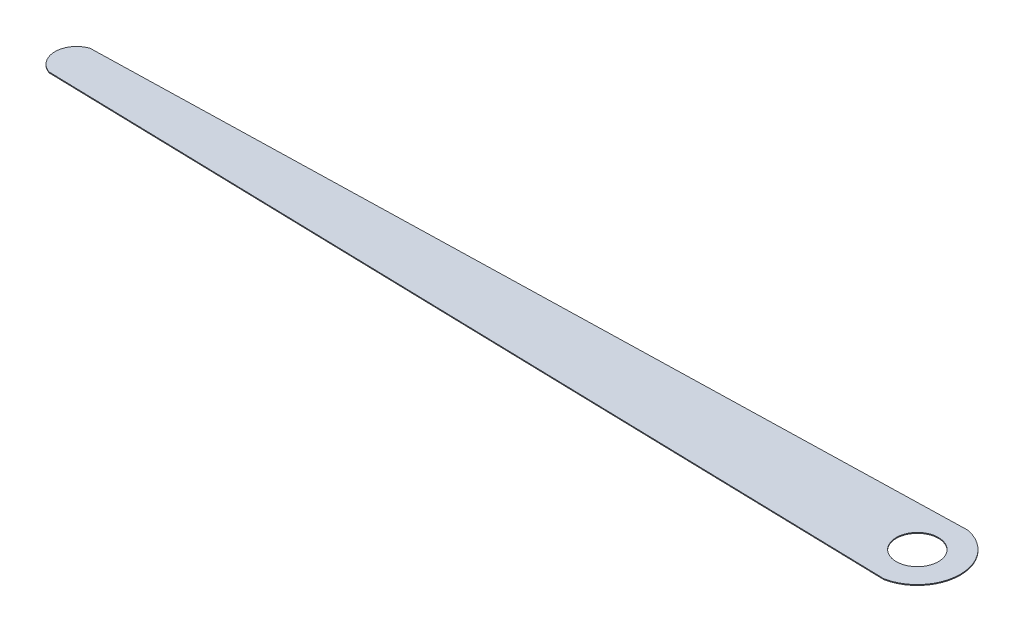
ISO-10303-21;
HEADER;
FILE_DESCRIPTION(('STEP AP214'),'2;1');
FILE_NAME('part.step','',(''),(''),'','','');
FILE_SCHEMA(('AUTOMOTIVE_DESIGN { 1 0 10303 214 1 1 1 1 }'));
ENDSEC;
DATA;
#1=APPLICATION_CONTEXT('core data for automotive mechanical design processes');
#2=APPLICATION_PROTOCOL_DEFINITION('international standard','automotive_design',2000,#1);
#3=PRODUCT_CONTEXT('',#1,'mechanical');
#4=PRODUCT('Part','Part','',(#3));
#5=PRODUCT_RELATED_PRODUCT_CATEGORY('part','',(#4));
#6=PRODUCT_DEFINITION_FORMATION('','',#4);
#7=PRODUCT_DEFINITION_CONTEXT('part definition',#1,'design');
#8=PRODUCT_DEFINITION('design','',#6,#7);
#9=PRODUCT_DEFINITION_SHAPE('','',#8);
#10=(LENGTH_UNIT() NAMED_UNIT(*) SI_UNIT(.MILLI.,.METRE.));
#11=(NAMED_UNIT(*) PLANE_ANGLE_UNIT() SI_UNIT($,.RADIAN.));
#12=(NAMED_UNIT(*) SI_UNIT($,.STERADIAN.) SOLID_ANGLE_UNIT());
#13=UNCERTAINTY_MEASURE_WITH_UNIT(LENGTH_MEASURE(1.E-05),#10,'distance_accuracy_value','');
#14=(GEOMETRIC_REPRESENTATION_CONTEXT(3) GLOBAL_UNCERTAINTY_ASSIGNED_CONTEXT((#13)) GLOBAL_UNIT_ASSIGNED_CONTEXT((#10,
#11,#12)) REPRESENTATION_CONTEXT('',''));
#15=CARTESIAN_POINT('',(0.,0.,0.));
#16=DIRECTION('',(0.,0.,1.));
#17=DIRECTION('',(1.,0.,0.));
#18=AXIS2_PLACEMENT_3D('',#15,#16,#17);
#19=CARTESIAN_POINT('',(-1.02879497937869,0.1,4.99999999999998));
#20=DIRECTION('',(0.,-1.,0.));
#21=DIRECTION('',(0.,0.,-1.));
#22=AXIS2_PLACEMENT_3D('',#19,#20,#21);
#23=PLANE('',#22);
#24=CARTESIAN_POINT('',(-1.02879497937869,0.1,4.99999999999998));
#25=DIRECTION('',(0.,1.,0.));
#26=DIRECTION('',(0.,0.,-1.));
#27=AXIS2_PLACEMENT_3D('',#24,#25,#26);
#28=CIRCLE('',#27,5.1047447643927);
#29=CARTESIAN_POINT('',(0.,0.1,9.99999999999997));
#30=VERTEX_POINT('',#29);
#31=CARTESIAN_POINT('',(0.,0.1,0.));
#32=VERTEX_POINT('',#31);
#33=EDGE_CURVE('E84',#30,#32,#28,.T.);
#34=ORIENTED_EDGE('',*,*,#33,.T.);
#35=DIRECTION('',(-0.999683329306351,0.,0.0251642823654999));
#36=VECTOR('',#35,1.);
#37=CARTESIAN_POINT('',(0.,0.1,0.));
#38=LINE('',#37,#36);
#39=CARTESIAN_POINT('',(-101.873461228566,0.1,2.56438460935946));
#40=VERTEX_POINT('',#39);
#41=EDGE_CURVE('E79',#32,#40,#38,.T.);
#42=ORIENTED_EDGE('',*,*,#41,.T.);
#43=CARTESIAN_POINT('',(-101.028794979379,0.1,4.99999999999998));
#44=DIRECTION('',(0.,1.,0.));
#45=DIRECTION('',(0.,0.,1.));
#46=AXIS2_PLACEMENT_3D('',#43,#44,#45);
#47=CIRCLE('',#46,2.57792230364699);
#48=CARTESIAN_POINT('',(-101.873461228566,0.1,7.4356153906405));
#49=VERTEX_POINT('',#48);
#50=EDGE_CURVE('E82',#40,#49,#47,.T.);
#51=ORIENTED_EDGE('',*,*,#50,.T.);
#52=DIRECTION('',(0.999683329306351,0.,0.0251642823654999));
#53=VECTOR('',#52,1.);
#54=CARTESIAN_POINT('',(-101.873461228566,0.1,7.4356153906405));
#55=LINE('',#54,#53);
#56=EDGE_CURVE('E49',#49,#30,#55,.T.);
#57=ORIENTED_EDGE('',*,*,#56,.T.);
#58=EDGE_LOOP('',(#34,#42,#51,#57));
#59=FACE_BOUND('',#58,.T.);
#60=CARTESIAN_POINT('',(-1.02879497937869,0.1,4.99999999999998));
#61=DIRECTION('',(0.,1.,0.));
#62=DIRECTION('',(0.,0.,1.));
#63=AXIS2_PLACEMENT_3D('',#60,#61,#62);
#64=CIRCLE('',#63,2.5);
#65=CARTESIAN_POINT('',(-1.02879497937869,0.1,7.49999999999998));
#66=VERTEX_POINT('',#65);
#67=EDGE_CURVE('E99',#66,#66,#64,.T.);
#68=ORIENTED_EDGE('',*,*,#67,.F.);
#69=EDGE_LOOP('',(#68));
#70=FACE_BOUND('',#69,.T.);
#71=ADVANCED_FACE('F32',(#59,#70),#23,.F.);
#72=CARTESIAN_POINT('',(-1.02879497937869,0.,4.99999999999998));
#73=DIRECTION('',(0.,-1.,0.));
#74=DIRECTION('',(0.,0.,-1.));
#75=AXIS2_PLACEMENT_3D('',#72,#73,#74);
#76=PLANE('',#75);
#77=CARTESIAN_POINT('',(-1.02879497937869,0.,4.99999999999998));
#78=DIRECTION('',(0.,1.,0.));
#79=DIRECTION('',(0.,0.,-1.));
#80=AXIS2_PLACEMENT_3D('',#77,#78,#79);
#81=CIRCLE('',#80,5.1047447643927);
#82=CARTESIAN_POINT('',(0.,0.,9.99999999999997));
#83=VERTEX_POINT('',#82);
#84=CARTESIAN_POINT('',(0.,0.,0.));
#85=VERTEX_POINT('',#84);
#86=EDGE_CURVE('E96',#83,#85,#81,.T.);
#87=ORIENTED_EDGE('',*,*,#86,.F.);
#88=DIRECTION('',(0.999683329306351,0.,0.0251642823654999));
#89=VECTOR('',#88,1.);
#90=CARTESIAN_POINT('',(-101.873461228566,0.,7.4356153906405));
#91=LINE('',#90,#89);
#92=CARTESIAN_POINT('',(-101.873461228566,0.,7.4356153906405));
#93=VERTEX_POINT('',#92);
#94=EDGE_CURVE('E72',#93,#83,#91,.T.);
#95=ORIENTED_EDGE('',*,*,#94,.F.);
#96=CARTESIAN_POINT('',(-101.028794979379,0.,4.99999999999998));
#97=DIRECTION('',(0.,1.,0.));
#98=DIRECTION('',(0.,0.,1.));
#99=AXIS2_PLACEMENT_3D('',#96,#97,#98);
#100=CIRCLE('',#99,2.57792230364699);
#101=CARTESIAN_POINT('',(-101.873461228566,0.,2.56438460935946));
#102=VERTEX_POINT('',#101);
#103=EDGE_CURVE('E66',#102,#93,#100,.T.);
#104=ORIENTED_EDGE('',*,*,#103,.F.);
#105=DIRECTION('',(-0.999683329306351,0.,0.0251642823654999));
#106=VECTOR('',#105,1.);
#107=CARTESIAN_POINT('',(0.,0.,0.));
#108=LINE('',#107,#106);
#109=EDGE_CURVE('E88',#85,#102,#108,.T.);
#110=ORIENTED_EDGE('',*,*,#109,.F.);
#111=EDGE_LOOP('',(#87,#95,#104,#110));
#112=FACE_BOUND('',#111,.T.);
#113=CARTESIAN_POINT('',(-1.02879497937869,0.,4.99999999999998));
#114=DIRECTION('',(0.,1.,0.));
#115=DIRECTION('',(0.,0.,1.));
#116=AXIS2_PLACEMENT_3D('',#113,#114,#115);
#117=CIRCLE('',#116,2.5);
#118=CARTESIAN_POINT('',(-1.02879497937869,0.,7.49999999999998));
#119=VERTEX_POINT('',#118);
#120=EDGE_CURVE('E111',#119,#119,#117,.T.);
#121=ORIENTED_EDGE('',*,*,#120,.T.);
#122=EDGE_LOOP('',(#121));
#123=FACE_BOUND('',#122,.T.);
#124=ADVANCED_FACE('F107',(#112,#123),#76,.T.);
#125=CARTESIAN_POINT('',(-1.02879497937869,0.1,4.99999999999998));
#126=DIRECTION('',(0.,-1.,0.));
#127=DIRECTION('',(0.,0.,-1.));
#128=AXIS2_PLACEMENT_3D('',#125,#126,#127);
#129=CYLINDRICAL_SURFACE('',#128,5.1047447643927);
#130=ORIENTED_EDGE('',*,*,#86,.T.);
#131=DIRECTION('',(0.,-1.,0.));
#132=VECTOR('',#131,1.);
#133=CARTESIAN_POINT('',(0.,0.1,0.));
#134=LINE('',#133,#132);
#135=EDGE_CURVE('E11',#32,#85,#134,.T.);
#136=ORIENTED_EDGE('',*,*,#135,.F.);
#137=ORIENTED_EDGE('',*,*,#33,.F.);
#138=DIRECTION('',(0.,-1.,0.));
#139=VECTOR('',#138,1.);
#140=CARTESIAN_POINT('',(0.,0.1,9.99999999999997));
#141=LINE('',#140,#139);
#142=EDGE_CURVE('E92',#30,#83,#141,.T.);
#143=ORIENTED_EDGE('',*,*,#142,.T.);
#144=EDGE_LOOP('',(#130,#136,#137,#143));
#145=FACE_BOUND('',#144,.T.);
#146=ADVANCED_FACE('F34',(#145),#129,.T.);
#147=CARTESIAN_POINT('',(0.,0.1,0.));
#148=DIRECTION('',(0.0251642823654999,0.,0.999683329306351));
#149=DIRECTION('',(0.999683329306351,0.,-0.0251642823654999));
#150=AXIS2_PLACEMENT_3D('',#147,#148,#149);
#151=PLANE('',#150);
#152=ORIENTED_EDGE('',*,*,#109,.T.);
#153=DIRECTION('',(0.,-1.,0.));
#154=VECTOR('',#153,1.);
#155=CARTESIAN_POINT('',(-101.873461228566,0.1,2.56438460935946));
#156=LINE('',#155,#154);
#157=EDGE_CURVE('E41',#40,#102,#156,.T.);
#158=ORIENTED_EDGE('',*,*,#157,.F.);
#159=ORIENTED_EDGE('',*,*,#41,.F.);
#160=ORIENTED_EDGE('',*,*,#135,.T.);
#161=EDGE_LOOP('',(#152,#158,#159,#160));
#162=FACE_BOUND('',#161,.T.);
#163=ADVANCED_FACE('F87',(#162),#151,.F.);
#164=CARTESIAN_POINT('',(-101.028794979379,0.1,4.99999999999998));
#165=DIRECTION('',(0.,-1.,0.));
#166=DIRECTION('',(0.,0.,-1.));
#167=AXIS2_PLACEMENT_3D('',#164,#165,#166);
#168=CYLINDRICAL_SURFACE('',#167,2.57792230364699);
#169=ORIENTED_EDGE('',*,*,#103,.T.);
#170=DIRECTION('',(0.,-1.,0.));
#171=VECTOR('',#170,1.);
#172=CARTESIAN_POINT('',(-101.873461228566,0.1,7.4356153906405));
#173=LINE('',#172,#171);
#174=EDGE_CURVE('E89',#49,#93,#173,.T.);
#175=ORIENTED_EDGE('',*,*,#174,.F.);
#176=ORIENTED_EDGE('',*,*,#50,.F.);
#177=ORIENTED_EDGE('',*,*,#157,.T.);
#178=EDGE_LOOP('',(#169,#175,#176,#177));
#179=FACE_BOUND('',#178,.T.);
#180=ADVANCED_FACE('F90',(#179),#168,.T.);
#181=CARTESIAN_POINT('',(-101.873461228566,0.1,7.4356153906405));
#182=DIRECTION('',(0.0251642823654999,0.,-0.999683329306351));
#183=DIRECTION('',(-0.999683329306351,0.,-0.0251642823654999));
#184=AXIS2_PLACEMENT_3D('',#181,#182,#183);
#185=PLANE('',#184);
#186=ORIENTED_EDGE('',*,*,#94,.T.);
#187=ORIENTED_EDGE('',*,*,#142,.F.);
#188=ORIENTED_EDGE('',*,*,#56,.F.);
#189=ORIENTED_EDGE('',*,*,#174,.T.);
#190=EDGE_LOOP('',(#186,#187,#188,#189));
#191=FACE_BOUND('',#190,.T.);
#192=ADVANCED_FACE('F104',(#191),#185,.F.);
#193=CARTESIAN_POINT('',(-1.02879497937869,0.1,4.99999999999998));
#194=DIRECTION('',(0.,-1.,0.));
#195=DIRECTION('',(0.,0.,-1.));
#196=AXIS2_PLACEMENT_3D('',#193,#194,#195);
#197=CYLINDRICAL_SURFACE('',#196,2.5);
#198=ORIENTED_EDGE('',*,*,#67,.T.);
#199=EDGE_LOOP('',(#198));
#200=FACE_BOUND('',#199,.T.);
#201=ORIENTED_EDGE('',*,*,#120,.F.);
#202=EDGE_LOOP('',(#201));
#203=FACE_BOUND('',#202,.T.);
#204=ADVANCED_FACE('F117',(#200,#203),#197,.F.);
#205=CLOSED_SHELL('',(#71,#124,#146,#163,#180,#192,#204));
#206=MANIFOLD_SOLID_BREP('B2',#205);
#207=ADVANCED_BREP_SHAPE_REPRESENTATION('',(#18,#206),#14);
#208=SHAPE_DEFINITION_REPRESENTATION(#9,#207);
ENDSEC;
END-ISO-10303-21;
